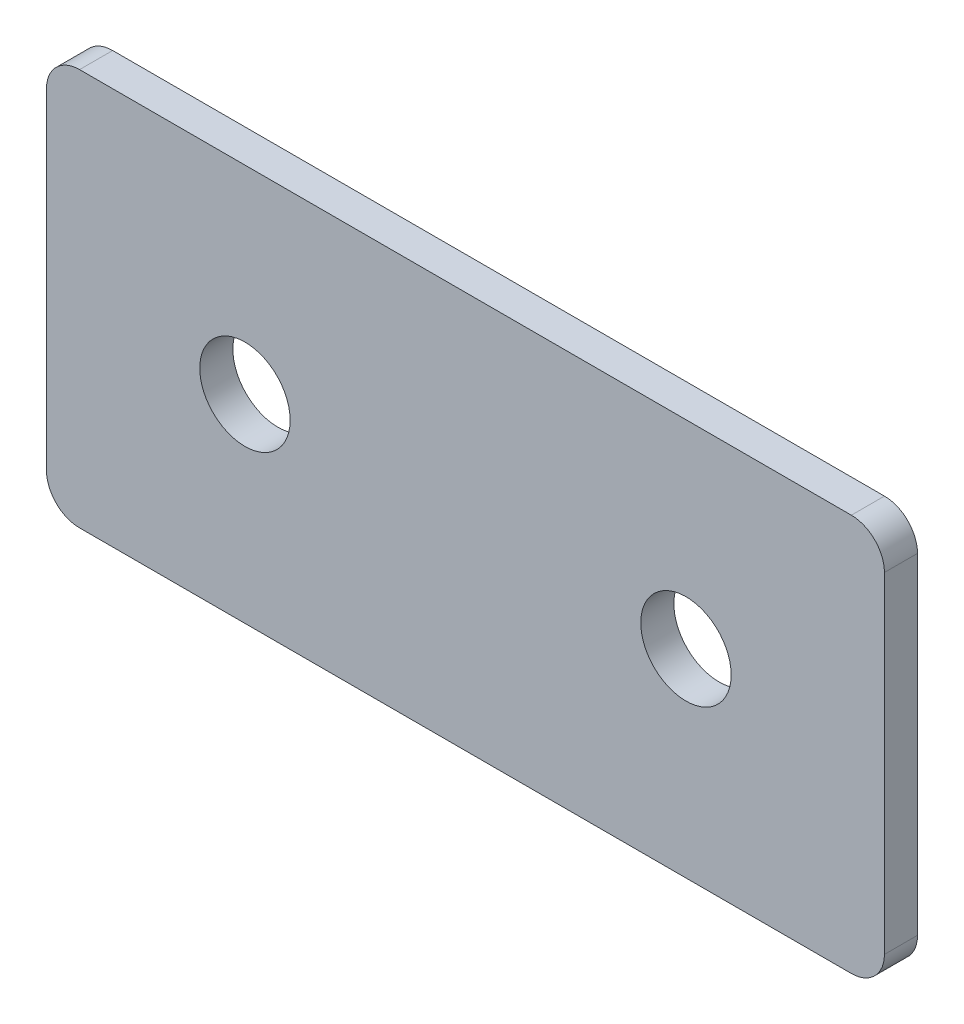
ISO-10303-21;
HEADER;
FILE_DESCRIPTION(('STEP AP214'),'2;1');
FILE_NAME('part.step','',(''),(''),'','','');
FILE_SCHEMA(('AUTOMOTIVE_DESIGN { 1 0 10303 214 1 1 1 1 }'));
ENDSEC;
DATA;
#1=APPLICATION_CONTEXT('core data for automotive mechanical design processes');
#2=APPLICATION_PROTOCOL_DEFINITION('international standard','automotive_design',2000,#1);
#3=PRODUCT_CONTEXT('',#1,'mechanical');
#4=PRODUCT('Part','Part','',(#3));
#5=PRODUCT_RELATED_PRODUCT_CATEGORY('part','',(#4));
#6=PRODUCT_DEFINITION_FORMATION('','',#4);
#7=PRODUCT_DEFINITION_CONTEXT('part definition',#1,'design');
#8=PRODUCT_DEFINITION('design','',#6,#7);
#9=PRODUCT_DEFINITION_SHAPE('','',#8);
#10=(LENGTH_UNIT() NAMED_UNIT(*) SI_UNIT(.MILLI.,.METRE.));
#11=(NAMED_UNIT(*) PLANE_ANGLE_UNIT() SI_UNIT($,.RADIAN.));
#12=(NAMED_UNIT(*) SI_UNIT($,.STERADIAN.) SOLID_ANGLE_UNIT());
#13=UNCERTAINTY_MEASURE_WITH_UNIT(LENGTH_MEASURE(1.E-05),#10,'distance_accuracy_value','');
#14=(GEOMETRIC_REPRESENTATION_CONTEXT(3) GLOBAL_UNCERTAINTY_ASSIGNED_CONTEXT((#13)) GLOBAL_UNIT_ASSIGNED_CONTEXT((#10,
#11,#12)) REPRESENTATION_CONTEXT('',''));
#15=CARTESIAN_POINT('',(0.,0.,0.));
#16=DIRECTION('',(0.,0.,1.));
#17=DIRECTION('',(1.,0.,0.));
#18=AXIS2_PLACEMENT_3D('',#15,#16,#17);
#19=CARTESIAN_POINT('',(0.,0.,3.));
#20=DIRECTION('',(0.,0.,-1.));
#21=DIRECTION('',(-1.,0.,0.));
#22=AXIS2_PLACEMENT_3D('',#19,#20,#21);
#23=PLANE('',#22);
#24=CARTESIAN_POINT('',(40.,0.,3.));
#25=DIRECTION('',(0.,0.,1.));
#26=DIRECTION('',(1.,0.,0.));
#27=AXIS2_PLACEMENT_3D('',#24,#25,#26);
#28=CIRCLE('',#27,4.1);
#29=CARTESIAN_POINT('',(44.1,0.,3.));
#30=VERTEX_POINT('',#29);
#31=EDGE_CURVE('E154',#30,#30,#28,.T.);
#32=ORIENTED_EDGE('',*,*,#31,.F.);
#33=EDGE_LOOP('',(#32));
#34=FACE_BOUND('',#33,.T.);
#35=CARTESIAN_POINT('',(0.,0.,3.));
#36=DIRECTION('',(0.,0.,1.));
#37=DIRECTION('',(1.,0.,0.));
#38=AXIS2_PLACEMENT_3D('',#35,#36,#37);
#39=CIRCLE('',#38,4.1);
#40=CARTESIAN_POINT('',(4.1,0.,3.));
#41=VERTEX_POINT('',#40);
#42=EDGE_CURVE('E107',#41,#41,#39,.T.);
#43=ORIENTED_EDGE('',*,*,#42,.F.);
#44=EDGE_LOOP('',(#43));
#45=FACE_BOUND('',#44,.T.);
#46=DIRECTION('',(1.,0.,0.));
#47=VECTOR('',#46,1.);
#48=CARTESIAN_POINT('',(-18.,-18.,3.));
#49=LINE('',#48,#47);
#50=CARTESIAN_POINT('',(-15.,-18.,3.));
#51=VERTEX_POINT('',#50);
#52=CARTESIAN_POINT('',(55.,-18.,3.));
#53=VERTEX_POINT('',#52);
#54=EDGE_CURVE('E84',#51,#53,#49,.T.);
#55=ORIENTED_EDGE('',*,*,#54,.T.);
#56=CARTESIAN_POINT('',(55.,-15.,3.));
#57=DIRECTION('',(0.,0.,-1.));
#58=DIRECTION('',(-1.,0.,0.));
#59=AXIS2_PLACEMENT_3D('',#56,#57,#58);
#60=CIRCLE('',#59,3.);
#61=CARTESIAN_POINT('',(58.,-15.,3.));
#62=VERTEX_POINT('',#61);
#63=EDGE_CURVE('E91',#53,#62,#60,.F.);
#64=ORIENTED_EDGE('',*,*,#63,.T.);
#65=DIRECTION('',(0.,1.,0.));
#66=VECTOR('',#65,1.);
#67=CARTESIAN_POINT('',(58.,-18.,3.));
#68=LINE('',#67,#66);
#69=CARTESIAN_POINT('',(58.,15.,3.));
#70=VERTEX_POINT('',#69);
#71=EDGE_CURVE('E102',#62,#70,#68,.T.);
#72=ORIENTED_EDGE('',*,*,#71,.T.);
#73=CARTESIAN_POINT('',(55.,15.,3.));
#74=DIRECTION('',(0.,0.,-1.));
#75=DIRECTION('',(-1.,0.,0.));
#76=AXIS2_PLACEMENT_3D('',#73,#74,#75);
#77=CIRCLE('',#76,3.);
#78=CARTESIAN_POINT('',(55.,18.,3.));
#79=VERTEX_POINT('',#78);
#80=EDGE_CURVE('E109',#70,#79,#77,.F.);
#81=ORIENTED_EDGE('',*,*,#80,.T.);
#82=DIRECTION('',(-1.,0.,0.));
#83=VECTOR('',#82,1.);
#84=CARTESIAN_POINT('',(58.,18.,3.));
#85=LINE('',#84,#83);
#86=CARTESIAN_POINT('',(-15.,18.,3.));
#87=VERTEX_POINT('',#86);
#88=EDGE_CURVE('E139',#79,#87,#85,.T.);
#89=ORIENTED_EDGE('',*,*,#88,.T.);
#90=CARTESIAN_POINT('',(-15.,15.,3.));
#91=DIRECTION('',(0.,0.,-1.));
#92=DIRECTION('',(-1.,0.,0.));
#93=AXIS2_PLACEMENT_3D('',#90,#91,#92);
#94=CIRCLE('',#93,3.);
#95=CARTESIAN_POINT('',(-18.,15.,3.));
#96=VERTEX_POINT('',#95);
#97=EDGE_CURVE('E92',#87,#96,#94,.F.);
#98=ORIENTED_EDGE('',*,*,#97,.T.);
#99=DIRECTION('',(0.,-1.,0.));
#100=VECTOR('',#99,1.);
#101=CARTESIAN_POINT('',(-18.,18.,3.));
#102=LINE('',#101,#100);
#103=CARTESIAN_POINT('',(-18.,-15.,3.));
#104=VERTEX_POINT('',#103);
#105=EDGE_CURVE('E86',#96,#104,#102,.T.);
#106=ORIENTED_EDGE('',*,*,#105,.T.);
#107=CARTESIAN_POINT('',(-15.,-15.,3.));
#108=DIRECTION('',(0.,0.,-1.));
#109=DIRECTION('',(-1.,0.,0.));
#110=AXIS2_PLACEMENT_3D('',#107,#108,#109);
#111=CIRCLE('',#110,3.);
#112=EDGE_CURVE('E82',#104,#51,#111,.F.);
#113=ORIENTED_EDGE('',*,*,#112,.T.);
#114=EDGE_LOOP('',(#55,#64,#72,#81,#89,#98,#106,#113));
#115=FACE_BOUND('',#114,.T.);
#116=ADVANCED_FACE('F16',(#34,#45,#115),#23,.F.);
#117=CARTESIAN_POINT('',(0.,0.,0.));
#118=DIRECTION('',(0.,0.,-1.));
#119=DIRECTION('',(-1.,0.,0.));
#120=AXIS2_PLACEMENT_3D('',#117,#118,#119);
#121=PLANE('',#120);
#122=CARTESIAN_POINT('',(40.,0.,0.));
#123=DIRECTION('',(0.,0.,1.));
#124=DIRECTION('',(1.,0.,0.));
#125=AXIS2_PLACEMENT_3D('',#122,#123,#124);
#126=CIRCLE('',#125,4.1);
#127=CARTESIAN_POINT('',(44.1,0.,0.));
#128=VERTEX_POINT('',#127);
#129=EDGE_CURVE('E150',#128,#128,#126,.T.);
#130=ORIENTED_EDGE('',*,*,#129,.T.);
#131=EDGE_LOOP('',(#130));
#132=FACE_BOUND('',#131,.T.);
#133=CARTESIAN_POINT('',(0.,0.,0.));
#134=DIRECTION('',(0.,0.,1.));
#135=DIRECTION('',(1.,0.,0.));
#136=AXIS2_PLACEMENT_3D('',#133,#134,#135);
#137=CIRCLE('',#136,4.1);
#138=CARTESIAN_POINT('',(4.1,0.,0.));
#139=VERTEX_POINT('',#138);
#140=EDGE_CURVE('E112',#139,#139,#137,.T.);
#141=ORIENTED_EDGE('',*,*,#140,.T.);
#142=EDGE_LOOP('',(#141));
#143=FACE_BOUND('',#142,.T.);
#144=DIRECTION('',(0.,1.,0.));
#145=VECTOR('',#144,1.);
#146=CARTESIAN_POINT('',(58.,-18.,0.));
#147=LINE('',#146,#145);
#148=CARTESIAN_POINT('',(58.,-15.,0.));
#149=VERTEX_POINT('',#148);
#150=CARTESIAN_POINT('',(58.,15.,0.));
#151=VERTEX_POINT('',#150);
#152=EDGE_CURVE('E141',#149,#151,#147,.T.);
#153=ORIENTED_EDGE('',*,*,#152,.F.);
#154=CARTESIAN_POINT('',(55.,-15.,0.));
#155=DIRECTION('',(0.,0.,-1.));
#156=DIRECTION('',(-1.,0.,0.));
#157=AXIS2_PLACEMENT_3D('',#154,#155,#156);
#158=CIRCLE('',#157,3.);
#159=CARTESIAN_POINT('',(55.,-18.,0.));
#160=VERTEX_POINT('',#159);
#161=EDGE_CURVE('E128',#149,#160,#158,.T.);
#162=ORIENTED_EDGE('',*,*,#161,.T.);
#163=DIRECTION('',(1.,0.,0.));
#164=VECTOR('',#163,1.);
#165=CARTESIAN_POINT('',(-18.,-18.,0.));
#166=LINE('',#165,#164);
#167=CARTESIAN_POINT('',(-15.,-18.,0.));
#168=VERTEX_POINT('',#167);
#169=EDGE_CURVE('E138',#168,#160,#166,.T.);
#170=ORIENTED_EDGE('',*,*,#169,.F.);
#171=CARTESIAN_POINT('',(-15.,-15.,0.));
#172=DIRECTION('',(0.,0.,-1.));
#173=DIRECTION('',(-1.,0.,0.));
#174=AXIS2_PLACEMENT_3D('',#171,#172,#173);
#175=CIRCLE('',#174,3.);
#176=CARTESIAN_POINT('',(-18.,-15.,0.));
#177=VERTEX_POINT('',#176);
#178=EDGE_CURVE('E106',#168,#177,#175,.T.);
#179=ORIENTED_EDGE('',*,*,#178,.T.);
#180=DIRECTION('',(0.,-1.,0.));
#181=VECTOR('',#180,1.);
#182=CARTESIAN_POINT('',(-18.,18.,0.));
#183=LINE('',#182,#181);
#184=CARTESIAN_POINT('',(-18.,15.,0.));
#185=VERTEX_POINT('',#184);
#186=EDGE_CURVE('E137',#185,#177,#183,.T.);
#187=ORIENTED_EDGE('',*,*,#186,.F.);
#188=CARTESIAN_POINT('',(-15.,15.,0.));
#189=DIRECTION('',(0.,0.,-1.));
#190=DIRECTION('',(-1.,0.,0.));
#191=AXIS2_PLACEMENT_3D('',#188,#189,#190);
#192=CIRCLE('',#191,3.);
#193=CARTESIAN_POINT('',(-15.,18.,0.));
#194=VERTEX_POINT('',#193);
#195=EDGE_CURVE('E31',#185,#194,#192,.T.);
#196=ORIENTED_EDGE('',*,*,#195,.T.);
#197=DIRECTION('',(-1.,0.,0.));
#198=VECTOR('',#197,1.);
#199=CARTESIAN_POINT('',(58.,18.,0.));
#200=LINE('',#199,#198);
#201=CARTESIAN_POINT('',(55.,18.,0.));
#202=VERTEX_POINT('',#201);
#203=EDGE_CURVE('E148',#202,#194,#200,.T.);
#204=ORIENTED_EDGE('',*,*,#203,.F.);
#205=CARTESIAN_POINT('',(55.,15.,0.));
#206=DIRECTION('',(0.,0.,-1.));
#207=DIRECTION('',(-1.,0.,0.));
#208=AXIS2_PLACEMENT_3D('',#205,#206,#207);
#209=CIRCLE('',#208,3.);
#210=EDGE_CURVE('E124',#202,#151,#209,.T.);
#211=ORIENTED_EDGE('',*,*,#210,.T.);
#212=EDGE_LOOP('',(#153,#162,#170,#179,#187,#196,#204,#211));
#213=FACE_BOUND('',#212,.T.);
#214=ADVANCED_FACE('F160',(#132,#143,#213),#121,.T.);
#215=CARTESIAN_POINT('',(0.,0.,3.));
#216=DIRECTION('',(0.,0.,-1.));
#217=DIRECTION('',(-1.,0.,0.));
#218=AXIS2_PLACEMENT_3D('',#215,#216,#217);
#219=CYLINDRICAL_SURFACE('',#218,4.1);
#220=ORIENTED_EDGE('',*,*,#42,.T.);
#221=EDGE_LOOP('',(#220));
#222=FACE_BOUND('',#221,.T.);
#223=ORIENTED_EDGE('',*,*,#140,.F.);
#224=EDGE_LOOP('',(#223));
#225=FACE_BOUND('',#224,.T.);
#226=ADVANCED_FACE('F165',(#222,#225),#219,.F.);
#227=CARTESIAN_POINT('',(40.,0.,3.));
#228=DIRECTION('',(0.,0.,-1.));
#229=DIRECTION('',(-1.,0.,0.));
#230=AXIS2_PLACEMENT_3D('',#227,#228,#229);
#231=CYLINDRICAL_SURFACE('',#230,4.1);
#232=ORIENTED_EDGE('',*,*,#31,.T.);
#233=EDGE_LOOP('',(#232));
#234=FACE_BOUND('',#233,.T.);
#235=ORIENTED_EDGE('',*,*,#129,.F.);
#236=EDGE_LOOP('',(#235));
#237=FACE_BOUND('',#236,.T.);
#238=ADVANCED_FACE('F163',(#234,#237),#231,.F.);
#239=CARTESIAN_POINT('',(-18.,18.,0.));
#240=DIRECTION('',(-1.,0.,0.));
#241=DIRECTION('',(0.,0.,1.));
#242=AXIS2_PLACEMENT_3D('',#239,#240,#241);
#243=PLANE('',#242);
#244=ORIENTED_EDGE('',*,*,#186,.T.);
#245=DIRECTION('',(0.,0.,1.));
#246=VECTOR('',#245,1.);
#247=CARTESIAN_POINT('',(-18.,-15.,0.));
#248=LINE('',#247,#246);
#249=EDGE_CURVE('E132',#177,#104,#248,.T.);
#250=ORIENTED_EDGE('',*,*,#249,.T.);
#251=ORIENTED_EDGE('',*,*,#105,.F.);
#252=DIRECTION('',(0.,0.,1.));
#253=VECTOR('',#252,1.);
#254=CARTESIAN_POINT('',(-18.,15.,0.));
#255=LINE('',#254,#253);
#256=EDGE_CURVE('E130',#96,#185,#255,.F.);
#257=ORIENTED_EDGE('',*,*,#256,.T.);
#258=EDGE_LOOP('',(#244,#250,#251,#257));
#259=FACE_BOUND('',#258,.T.);
#260=ADVANCED_FACE('F135',(#259),#243,.T.);
#261=CARTESIAN_POINT('',(58.,18.,0.));
#262=DIRECTION('',(0.,1.,0.));
#263=DIRECTION('',(0.,0.,1.));
#264=AXIS2_PLACEMENT_3D('',#261,#262,#263);
#265=PLANE('',#264);
#266=ORIENTED_EDGE('',*,*,#203,.T.);
#267=DIRECTION('',(0.,0.,1.));
#268=VECTOR('',#267,1.);
#269=CARTESIAN_POINT('',(-15.,18.,0.));
#270=LINE('',#269,#268);
#271=EDGE_CURVE('E10',#194,#87,#270,.T.);
#272=ORIENTED_EDGE('',*,*,#271,.T.);
#273=ORIENTED_EDGE('',*,*,#88,.F.);
#274=DIRECTION('',(0.,0.,1.));
#275=VECTOR('',#274,1.);
#276=CARTESIAN_POINT('',(55.,18.,0.));
#277=LINE('',#276,#275);
#278=EDGE_CURVE('E24',#79,#202,#277,.F.);
#279=ORIENTED_EDGE('',*,*,#278,.T.);
#280=EDGE_LOOP('',(#266,#272,#273,#279));
#281=FACE_BOUND('',#280,.T.);
#282=ADVANCED_FACE('F173',(#281),#265,.T.);
#283=CARTESIAN_POINT('',(58.,-18.,0.));
#284=DIRECTION('',(1.,0.,0.));
#285=DIRECTION('',(0.,0.,-1.));
#286=AXIS2_PLACEMENT_3D('',#283,#284,#285);
#287=PLANE('',#286);
#288=ORIENTED_EDGE('',*,*,#71,.F.);
#289=DIRECTION('',(0.,0.,1.));
#290=VECTOR('',#289,1.);
#291=CARTESIAN_POINT('',(58.,-15.,0.));
#292=LINE('',#291,#290);
#293=EDGE_CURVE('E122',#62,#149,#292,.F.);
#294=ORIENTED_EDGE('',*,*,#293,.T.);
#295=ORIENTED_EDGE('',*,*,#152,.T.);
#296=DIRECTION('',(0.,0.,1.));
#297=VECTOR('',#296,1.);
#298=CARTESIAN_POINT('',(58.,15.,0.));
#299=LINE('',#298,#297);
#300=EDGE_CURVE('E119',#151,#70,#299,.T.);
#301=ORIENTED_EDGE('',*,*,#300,.T.);
#302=EDGE_LOOP('',(#288,#294,#295,#301));
#303=FACE_BOUND('',#302,.T.);
#304=ADVANCED_FACE('F204',(#303),#287,.T.);
#305=CARTESIAN_POINT('',(-18.,-18.,0.));
#306=DIRECTION('',(0.,-1.,0.));
#307=DIRECTION('',(0.,0.,-1.));
#308=AXIS2_PLACEMENT_3D('',#305,#306,#307);
#309=PLANE('',#308);
#310=ORIENTED_EDGE('',*,*,#169,.T.);
#311=DIRECTION('',(0.,0.,1.));
#312=VECTOR('',#311,1.);
#313=CARTESIAN_POINT('',(55.,-18.,0.));
#314=LINE('',#313,#312);
#315=EDGE_CURVE('E101',#160,#53,#314,.T.);
#316=ORIENTED_EDGE('',*,*,#315,.T.);
#317=ORIENTED_EDGE('',*,*,#54,.F.);
#318=DIRECTION('',(0.,0.,1.));
#319=VECTOR('',#318,1.);
#320=CARTESIAN_POINT('',(-15.,-18.,0.));
#321=LINE('',#320,#319);
#322=EDGE_CURVE('E98',#51,#168,#321,.F.);
#323=ORIENTED_EDGE('',*,*,#322,.T.);
#324=EDGE_LOOP('',(#310,#316,#317,#323));
#325=FACE_BOUND('',#324,.T.);
#326=ADVANCED_FACE('F97',(#325),#309,.T.);
#327=CARTESIAN_POINT('',(55.,-15.,0.));
#328=DIRECTION('',(0.,0.,1.));
#329=DIRECTION('',(1.,0.,0.));
#330=AXIS2_PLACEMENT_3D('',#327,#328,#329);
#331=CYLINDRICAL_SURFACE('',#330,3.);
#332=ORIENTED_EDGE('',*,*,#161,.F.);
#333=ORIENTED_EDGE('',*,*,#293,.F.);
#334=ORIENTED_EDGE('',*,*,#63,.F.);
#335=ORIENTED_EDGE('',*,*,#315,.F.);
#336=EDGE_LOOP('',(#332,#333,#334,#335));
#337=FACE_BOUND('',#336,.T.);
#338=ADVANCED_FACE('F187',(#337),#331,.T.);
#339=CARTESIAN_POINT('',(-15.,-15.,0.));
#340=DIRECTION('',(0.,0.,1.));
#341=DIRECTION('',(1.,0.,0.));
#342=AXIS2_PLACEMENT_3D('',#339,#340,#341);
#343=CYLINDRICAL_SURFACE('',#342,3.);
#344=ORIENTED_EDGE('',*,*,#178,.F.);
#345=ORIENTED_EDGE('',*,*,#322,.F.);
#346=ORIENTED_EDGE('',*,*,#112,.F.);
#347=ORIENTED_EDGE('',*,*,#249,.F.);
#348=EDGE_LOOP('',(#344,#345,#346,#347));
#349=FACE_BOUND('',#348,.T.);
#350=ADVANCED_FACE('F105',(#349),#343,.T.);
#351=CARTESIAN_POINT('',(-15.,15.,0.));
#352=DIRECTION('',(0.,0.,1.));
#353=DIRECTION('',(1.,0.,0.));
#354=AXIS2_PLACEMENT_3D('',#351,#352,#353);
#355=CYLINDRICAL_SURFACE('',#354,3.);
#356=ORIENTED_EDGE('',*,*,#195,.F.);
#357=ORIENTED_EDGE('',*,*,#256,.F.);
#358=ORIENTED_EDGE('',*,*,#97,.F.);
#359=ORIENTED_EDGE('',*,*,#271,.F.);
#360=EDGE_LOOP('',(#356,#357,#358,#359));
#361=FACE_BOUND('',#360,.T.);
#362=ADVANCED_FACE('F192',(#361),#355,.T.);
#363=CARTESIAN_POINT('',(55.,15.,0.));
#364=DIRECTION('',(0.,0.,1.));
#365=DIRECTION('',(1.,0.,0.));
#366=AXIS2_PLACEMENT_3D('',#363,#364,#365);
#367=CYLINDRICAL_SURFACE('',#366,3.);
#368=ORIENTED_EDGE('',*,*,#210,.F.);
#369=ORIENTED_EDGE('',*,*,#278,.F.);
#370=ORIENTED_EDGE('',*,*,#80,.F.);
#371=ORIENTED_EDGE('',*,*,#300,.F.);
#372=EDGE_LOOP('',(#368,#369,#370,#371));
#373=FACE_BOUND('',#372,.T.);
#374=ADVANCED_FACE('F18',(#373),#367,.T.);
#375=CLOSED_SHELL('',(#116,#214,#226,#238,#260,#282,#304,#326,#338,#350,#362,#374));
#376=MANIFOLD_SOLID_BREP('B1',#375);
#377=ADVANCED_BREP_SHAPE_REPRESENTATION('',(#18,#376),#14);
#378=SHAPE_DEFINITION_REPRESENTATION(#9,#377);
ENDSEC;
END-ISO-10303-21;
